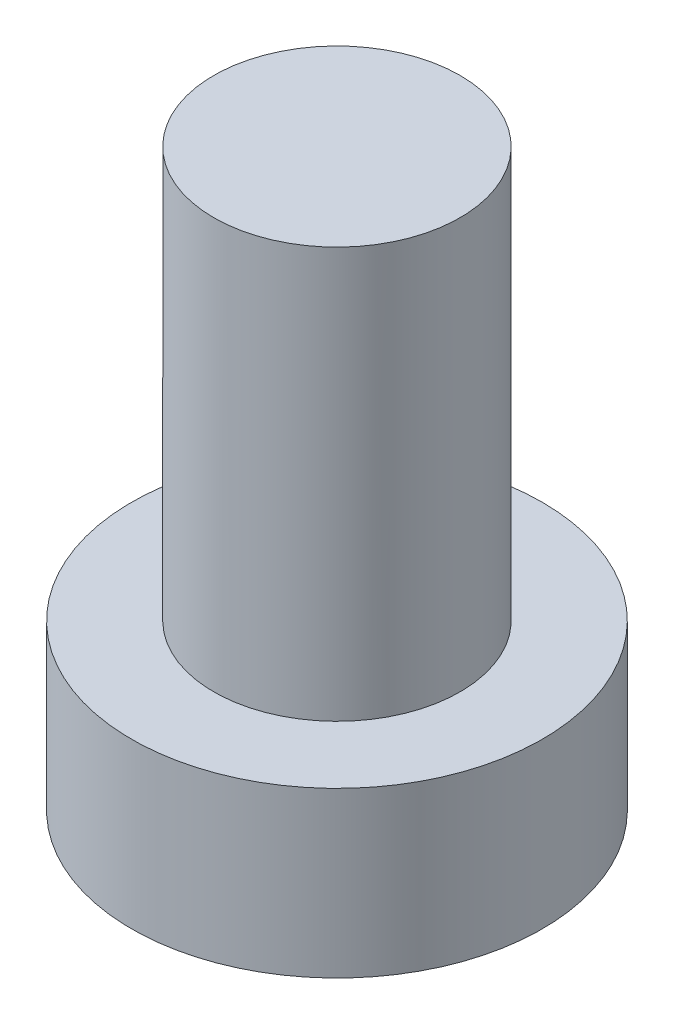
ISO-10303-21;
HEADER;
FILE_DESCRIPTION(('STEP AP214'),'2;1');
FILE_NAME('part.step','',(''),(''),'','','');
FILE_SCHEMA(('AUTOMOTIVE_DESIGN { 1 0 10303 214 1 1 1 1 }'));
ENDSEC;
DATA;
#1=APPLICATION_CONTEXT('core data for automotive mechanical design processes');
#2=APPLICATION_PROTOCOL_DEFINITION('international standard','automotive_design',2000,#1);
#3=PRODUCT_CONTEXT('',#1,'mechanical');
#4=PRODUCT('Part','Part','',(#3));
#5=PRODUCT_RELATED_PRODUCT_CATEGORY('part','',(#4));
#6=PRODUCT_DEFINITION_FORMATION('','',#4);
#7=PRODUCT_DEFINITION_CONTEXT('part definition',#1,'design');
#8=PRODUCT_DEFINITION('design','',#6,#7);
#9=PRODUCT_DEFINITION_SHAPE('','',#8);
#10=(LENGTH_UNIT() NAMED_UNIT(*) SI_UNIT(.MILLI.,.METRE.));
#11=(NAMED_UNIT(*) PLANE_ANGLE_UNIT() SI_UNIT($,.RADIAN.));
#12=(NAMED_UNIT(*) SI_UNIT($,.STERADIAN.) SOLID_ANGLE_UNIT());
#13=UNCERTAINTY_MEASURE_WITH_UNIT(LENGTH_MEASURE(1.E-05),#10,'distance_accuracy_value','');
#14=(GEOMETRIC_REPRESENTATION_CONTEXT(3) GLOBAL_UNCERTAINTY_ASSIGNED_CONTEXT((#13)) GLOBAL_UNIT_ASSIGNED_CONTEXT((#10,
#11,#12)) REPRESENTATION_CONTEXT('',''));
#15=CARTESIAN_POINT('',(0.,0.,0.));
#16=DIRECTION('',(0.,0.,1.));
#17=DIRECTION('',(1.,0.,0.));
#18=AXIS2_PLACEMENT_3D('',#15,#16,#17);
#19=CARTESIAN_POINT('',(0.,10.,0.));
#20=DIRECTION('',(0.,-1.,0.));
#21=DIRECTION('',(0.,0.,-1.));
#22=AXIS2_PLACEMENT_3D('',#19,#20,#21);
#23=CYLINDRICAL_SURFACE('',#22,3.);
#24=CARTESIAN_POINT('',(0.,10.,0.));
#25=DIRECTION('',(0.,1.,0.));
#26=DIRECTION('',(0.,0.,1.));
#27=AXIS2_PLACEMENT_3D('',#24,#25,#26);
#28=CIRCLE('',#27,3.);
#29=CARTESIAN_POINT('',(0.,10.,3.));
#30=VERTEX_POINT('',#29);
#31=EDGE_CURVE('E10',#30,#30,#28,.T.);
#32=ORIENTED_EDGE('',*,*,#31,.F.);
#33=EDGE_LOOP('',(#32));
#34=FACE_BOUND('',#33,.T.);
#35=CARTESIAN_POINT('',(0.,0.,0.));
#36=DIRECTION('',(0.,-1.,0.));
#37=DIRECTION('',(0.,0.,-1.));
#38=AXIS2_PLACEMENT_3D('',#35,#36,#37);
#39=CIRCLE('',#38,3.);
#40=CARTESIAN_POINT('',(0.,0.,-3.));
#41=VERTEX_POINT('',#40);
#42=EDGE_CURVE('E37',#41,#41,#39,.T.);
#43=ORIENTED_EDGE('',*,*,#42,.F.);
#44=EDGE_LOOP('',(#43));
#45=FACE_BOUND('',#44,.T.);
#46=ADVANCED_FACE('F31',(#34,#45),#23,.T.);
#47=CARTESIAN_POINT('',(0.,10.,0.));
#48=DIRECTION('',(0.,1.,0.));
#49=DIRECTION('',(0.,0.,1.));
#50=AXIS2_PLACEMENT_3D('',#47,#48,#49);
#51=PLANE('',#50);
#52=ORIENTED_EDGE('',*,*,#31,.T.);
#53=EDGE_LOOP('',(#52));
#54=FACE_BOUND('',#53,.T.);
#55=ADVANCED_FACE('F55',(#54),#51,.T.);
#56=CARTESIAN_POINT('',(0.,0.,0.));
#57=DIRECTION('',(0.,-1.,0.));
#58=DIRECTION('',(0.,0.,-1.));
#59=AXIS2_PLACEMENT_3D('',#56,#57,#58);
#60=PLANE('',#59);
#61=CARTESIAN_POINT('',(0.,0.,0.));
#62=DIRECTION('',(0.,-1.,0.));
#63=DIRECTION('',(0.,0.,-1.));
#64=AXIS2_PLACEMENT_3D('',#61,#62,#63);
#65=CIRCLE('',#64,5.);
#66=CARTESIAN_POINT('',(0.,0.,-5.));
#67=VERTEX_POINT('',#66);
#68=EDGE_CURVE('E45',#67,#67,#65,.T.);
#69=ORIENTED_EDGE('',*,*,#68,.F.);
#70=EDGE_LOOP('',(#69));
#71=FACE_BOUND('',#70,.T.);
#72=ORIENTED_EDGE('',*,*,#42,.T.);
#73=EDGE_LOOP('',(#72));
#74=FACE_BOUND('',#73,.T.);
#75=ADVANCED_FACE('F53',(#71,#74),#60,.F.);
#76=CARTESIAN_POINT('',(0.,-4.,0.));
#77=DIRECTION('',(0.,1.,0.));
#78=DIRECTION('',(0.,0.,1.));
#79=AXIS2_PLACEMENT_3D('',#76,#77,#78);
#80=CYLINDRICAL_SURFACE('',#79,5.);
#81=CARTESIAN_POINT('',(0.,-4.,0.));
#82=DIRECTION('',(0.,-1.,0.));
#83=DIRECTION('',(0.,0.,-1.));
#84=AXIS2_PLACEMENT_3D('',#81,#82,#83);
#85=CIRCLE('',#84,5.);
#86=CARTESIAN_POINT('',(0.,-4.,-5.));
#87=VERTEX_POINT('',#86);
#88=EDGE_CURVE('E41',#87,#87,#85,.T.);
#89=ORIENTED_EDGE('',*,*,#88,.F.);
#90=EDGE_LOOP('',(#89));
#91=FACE_BOUND('',#90,.T.);
#92=ORIENTED_EDGE('',*,*,#68,.T.);
#93=EDGE_LOOP('',(#92));
#94=FACE_BOUND('',#93,.T.);
#95=ADVANCED_FACE('F51',(#91,#94),#80,.T.);
#96=CARTESIAN_POINT('',(0.,-4.,0.));
#97=DIRECTION('',(0.,-1.,0.));
#98=DIRECTION('',(0.,0.,-1.));
#99=AXIS2_PLACEMENT_3D('',#96,#97,#98);
#100=PLANE('',#99);
#101=ORIENTED_EDGE('',*,*,#88,.T.);
#102=EDGE_LOOP('',(#101));
#103=FACE_BOUND('',#102,.T.);
#104=ADVANCED_FACE('F61',(#103),#100,.T.);
#105=CLOSED_SHELL('',(#46,#55,#75,#95,#104));
#106=MANIFOLD_SOLID_BREP('B2',#105);
#107=ADVANCED_BREP_SHAPE_REPRESENTATION('',(#18,#106),#14);
#108=SHAPE_DEFINITION_REPRESENTATION(#9,#107);
ENDSEC;
END-ISO-10303-21;
